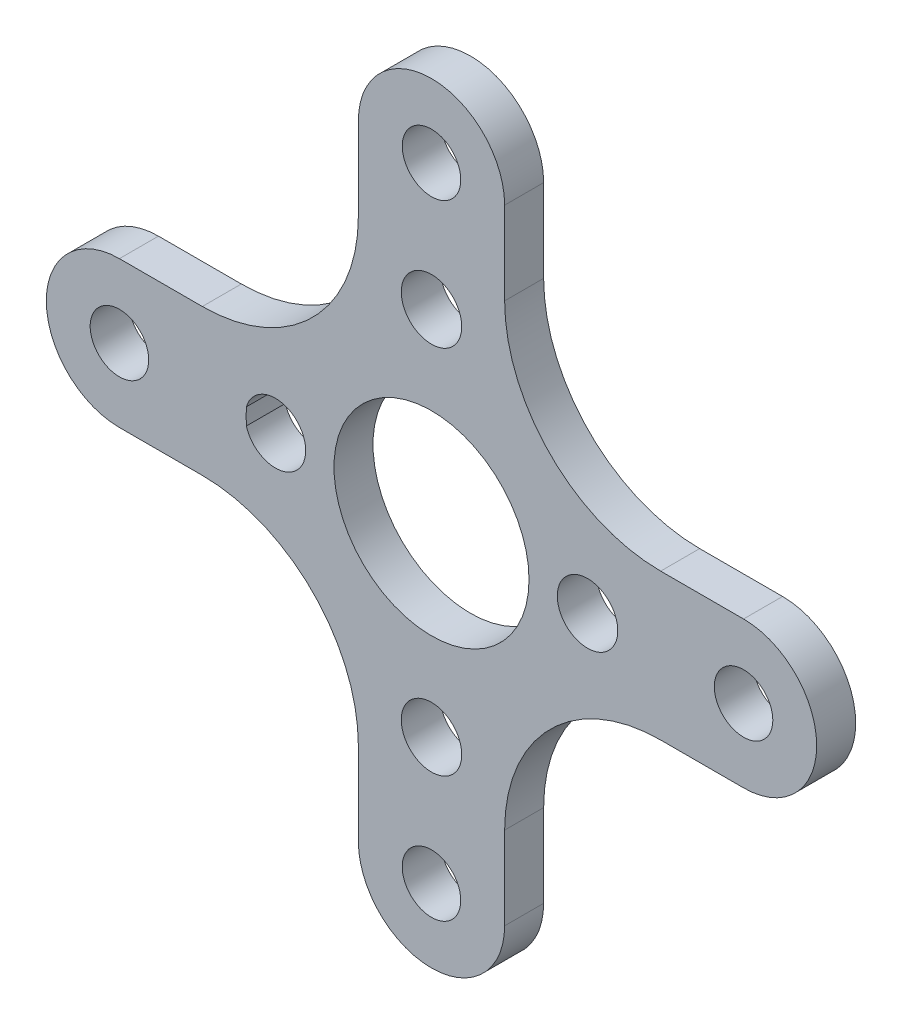
ISO-10303-21;
HEADER;
FILE_DESCRIPTION(('STEP AP214'),'2;1');
FILE_NAME('part.step','',(''),(''),'','','');
FILE_SCHEMA(('AUTOMOTIVE_DESIGN { 1 0 10303 214 1 1 1 1 }'));
ENDSEC;
DATA;
#1=APPLICATION_CONTEXT('core data for automotive mechanical design processes');
#2=APPLICATION_PROTOCOL_DEFINITION('international standard','automotive_design',2000,#1);
#3=PRODUCT_CONTEXT('',#1,'mechanical');
#4=PRODUCT('Part','Part','',(#3));
#5=PRODUCT_RELATED_PRODUCT_CATEGORY('part','',(#4));
#6=PRODUCT_DEFINITION_FORMATION('','',#4);
#7=PRODUCT_DEFINITION_CONTEXT('part definition',#1,'design');
#8=PRODUCT_DEFINITION('design','',#6,#7);
#9=PRODUCT_DEFINITION_SHAPE('','',#8);
#10=(LENGTH_UNIT() NAMED_UNIT(*) SI_UNIT(.MILLI.,.METRE.));
#11=(NAMED_UNIT(*) PLANE_ANGLE_UNIT() SI_UNIT($,.RADIAN.));
#12=(NAMED_UNIT(*) SI_UNIT($,.STERADIAN.) SOLID_ANGLE_UNIT());
#13=UNCERTAINTY_MEASURE_WITH_UNIT(LENGTH_MEASURE(1.E-05),#10,'distance_accuracy_value','');
#14=(GEOMETRIC_REPRESENTATION_CONTEXT(3) GLOBAL_UNCERTAINTY_ASSIGNED_CONTEXT((#13)) GLOBAL_UNIT_ASSIGNED_CONTEXT((#10,
#11,#12)) REPRESENTATION_CONTEXT('',''));
#15=CARTESIAN_POINT('',(0.,0.,0.));
#16=DIRECTION('',(0.,0.,1.));
#17=DIRECTION('',(1.,0.,0.));
#18=AXIS2_PLACEMENT_3D('',#15,#16,#17);
#19=CARTESIAN_POINT('',(-11.7499999999999,11.7499999999999,2.));
#20=DIRECTION('',(0.,0.,-1.));
#21=DIRECTION('',(-1.,0.,0.));
#22=AXIS2_PLACEMENT_3D('',#19,#20,#21);
#23=PLANE('',#22);
#24=CARTESIAN_POINT('',(8.,0.,2.));
#25=DIRECTION('',(0.,0.,-1.));
#26=DIRECTION('',(-1.,0.,0.));
#27=AXIS2_PLACEMENT_3D('',#24,#25,#26);
#28=CIRCLE('',#27,1.55);
#29=CARTESIAN_POINT('',(6.45,0.,2.));
#30=VERTEX_POINT('',#29);
#31=EDGE_CURVE('E187',#30,#30,#28,.T.);
#32=ORIENTED_EDGE('',*,*,#31,.T.);
#33=EDGE_LOOP('',(#32));
#34=FACE_BOUND('',#33,.T.);
#35=CARTESIAN_POINT('',(0.,-9.5,2.));
#36=DIRECTION('',(0.,0.,-1.));
#37=DIRECTION('',(-1.,0.,0.));
#38=AXIS2_PLACEMENT_3D('',#35,#36,#37);
#39=CIRCLE('',#38,1.55);
#40=CARTESIAN_POINT('',(-1.55,-9.5,2.));
#41=VERTEX_POINT('',#40);
#42=EDGE_CURVE('E184',#41,#41,#39,.T.);
#43=ORIENTED_EDGE('',*,*,#42,.T.);
#44=EDGE_LOOP('',(#43));
#45=FACE_BOUND('',#44,.T.);
#46=CARTESIAN_POINT('',(-8.,0.,2.));
#47=DIRECTION('',(0.,0.,-1.));
#48=DIRECTION('',(-1.,0.,0.));
#49=AXIS2_PLACEMENT_3D('',#46,#47,#48);
#50=CIRCLE('',#49,1.55);
#51=CARTESIAN_POINT('',(-9.49046875,0.425444362136153,2.));
#52=VERTEX_POINT('',#51);
#53=CARTESIAN_POINT('',(-9.49046875,-0.425444362136152,2.));
#54=VERTEX_POINT('',#53);
#55=EDGE_CURVE('E181',#52,#54,#50,.T.);
#56=ORIENTED_EDGE('',*,*,#55,.T.);
#57=CARTESIAN_POINT('',(0.,0.,2.));
#58=DIRECTION('',(0.,0.,-1.));
#59=DIRECTION('',(-1.,0.,0.));
#60=AXIS2_PLACEMENT_3D('',#57,#58,#59);
#61=CIRCLE('',#60,9.5);
#62=EDGE_CURVE('E158',#54,#52,#61,.T.);
#63=ORIENTED_EDGE('',*,*,#62,.T.);
#64=EDGE_LOOP('',(#56,#63));
#65=FACE_BOUND('',#64,.T.);
#66=CARTESIAN_POINT('',(0.,9.5,2.));
#67=DIRECTION('',(0.,0.,-1.));
#68=DIRECTION('',(-1.,0.,0.));
#69=AXIS2_PLACEMENT_3D('',#66,#67,#68);
#70=CIRCLE('',#69,1.55);
#71=CARTESIAN_POINT('',(-1.55,9.5,2.));
#72=VERTEX_POINT('',#71);
#73=EDGE_CURVE('E178',#72,#72,#70,.T.);
#74=ORIENTED_EDGE('',*,*,#73,.T.);
#75=EDGE_LOOP('',(#74));
#76=FACE_BOUND('',#75,.T.);
#77=CARTESIAN_POINT('',(-11.7499999999999,11.7499999999999,2.));
#78=DIRECTION('',(0.,0.,-1.));
#79=DIRECTION('',(-1.,0.,0.));
#80=AXIS2_PLACEMENT_3D('',#77,#78,#79);
#81=CIRCLE('',#80,8.);
#82=CARTESIAN_POINT('',(-3.74999999999994,11.7499999999999,2.));
#83=VERTEX_POINT('',#82);
#84=CARTESIAN_POINT('',(-11.7499999999999,3.74999999999995,2.));
#85=VERTEX_POINT('',#84);
#86=EDGE_CURVE('E221',#83,#85,#81,.T.);
#87=ORIENTED_EDGE('',*,*,#86,.T.);
#88=DIRECTION('',(-1.,0.,0.));
#89=VECTOR('',#88,1.);
#90=CARTESIAN_POINT('',(-16.0000000000001,3.74999999999994,2.));
#91=LINE('',#90,#89);
#92=CARTESIAN_POINT('',(-16.0000000000001,3.75,2.));
#93=VERTEX_POINT('',#92);
#94=EDGE_CURVE('E224',#85,#93,#91,.T.);
#95=ORIENTED_EDGE('',*,*,#94,.T.);
#96=CARTESIAN_POINT('',(-16.0000000000001,0.,2.));
#97=DIRECTION('',(0.,0.,1.));
#98=DIRECTION('',(1.,0.,0.));
#99=AXIS2_PLACEMENT_3D('',#96,#97,#98);
#100=CIRCLE('',#99,3.74999999999994);
#101=CARTESIAN_POINT('',(-16.0000000000001,-3.74999999999995,2.));
#102=VERTEX_POINT('',#101);
#103=EDGE_CURVE('E227',#93,#102,#100,.T.);
#104=ORIENTED_EDGE('',*,*,#103,.T.);
#105=DIRECTION('',(1.,0.,0.));
#106=VECTOR('',#105,1.);
#107=CARTESIAN_POINT('',(-16.0000000000001,-3.74999999999995,2.));
#108=LINE('',#107,#106);
#109=CARTESIAN_POINT('',(-11.75,-3.74999999999994,2.));
#110=VERTEX_POINT('',#109);
#111=EDGE_CURVE('E229',#102,#110,#108,.T.);
#112=ORIENTED_EDGE('',*,*,#111,.T.);
#113=CARTESIAN_POINT('',(-11.75,-11.7499999999999,2.));
#114=DIRECTION('',(0.,0.,-1.));
#115=DIRECTION('',(1.,0.,0.));
#116=AXIS2_PLACEMENT_3D('',#113,#114,#115);
#117=CIRCLE('',#116,8.);
#118=CARTESIAN_POINT('',(-3.75,-11.7499999999999,2.));
#119=VERTEX_POINT('',#118);
#120=EDGE_CURVE('E231',#110,#119,#117,.T.);
#121=ORIENTED_EDGE('',*,*,#120,.T.);
#122=DIRECTION('',(0.,-1.,0.));
#123=VECTOR('',#122,1.);
#124=CARTESIAN_POINT('',(-3.75,-16.0000000000001,2.));
#125=LINE('',#124,#123);
#126=CARTESIAN_POINT('',(-3.75000000000005,-16.0000000000001,2.));
#127=VERTEX_POINT('',#126);
#128=EDGE_CURVE('E233',#119,#127,#125,.T.);
#129=ORIENTED_EDGE('',*,*,#128,.T.);
#130=CARTESIAN_POINT('',(-1.08040746488181E-13,-16.0000000000001,2.));
#131=DIRECTION('',(0.,0.,1.));
#132=DIRECTION('',(1.,0.,0.));
#133=AXIS2_PLACEMENT_3D('',#130,#131,#132);
#134=CIRCLE('',#133,3.74999999999994);
#135=CARTESIAN_POINT('',(3.74999999999989,-16.0000000000001,2.));
#136=VERTEX_POINT('',#135);
#137=EDGE_CURVE('E235',#127,#136,#134,.T.);
#138=ORIENTED_EDGE('',*,*,#137,.T.);
#139=DIRECTION('',(0.,1.,0.));
#140=VECTOR('',#139,1.);
#141=CARTESIAN_POINT('',(3.74999999999989,-16.0000000000001,2.));
#142=LINE('',#141,#140);
#143=CARTESIAN_POINT('',(3.74999999999989,-11.75,2.));
#144=VERTEX_POINT('',#143);
#145=EDGE_CURVE('E237',#136,#144,#142,.T.);
#146=ORIENTED_EDGE('',*,*,#145,.T.);
#147=CARTESIAN_POINT('',(11.7499999999999,-11.75,2.));
#148=DIRECTION('',(0.,0.,-1.));
#149=DIRECTION('',(1.,0.,0.));
#150=AXIS2_PLACEMENT_3D('',#147,#148,#149);
#151=CIRCLE('',#150,8.);
#152=CARTESIAN_POINT('',(11.7499999999999,-3.75,2.));
#153=VERTEX_POINT('',#152);
#154=EDGE_CURVE('E239',#144,#153,#151,.T.);
#155=ORIENTED_EDGE('',*,*,#154,.T.);
#156=DIRECTION('',(1.,0.,0.));
#157=VECTOR('',#156,1.);
#158=CARTESIAN_POINT('',(16.,-3.75,2.));
#159=LINE('',#158,#157);
#160=CARTESIAN_POINT('',(16.,-3.75000000000006,2.));
#161=VERTEX_POINT('',#160);
#162=EDGE_CURVE('E241',#153,#161,#159,.T.);
#163=ORIENTED_EDGE('',*,*,#162,.T.);
#164=CARTESIAN_POINT('',(16.,-1.11727033874631E-13,2.));
#165=DIRECTION('',(0.,0.,1.));
#166=DIRECTION('',(1.,0.,0.));
#167=AXIS2_PLACEMENT_3D('',#164,#165,#166);
#168=CIRCLE('',#167,3.74999999999994);
#169=CARTESIAN_POINT('',(16.,3.74999999999989,2.));
#170=VERTEX_POINT('',#169);
#171=EDGE_CURVE('E243',#161,#170,#168,.T.);
#172=ORIENTED_EDGE('',*,*,#171,.T.);
#173=DIRECTION('',(-1.,0.,0.));
#174=VECTOR('',#173,1.);
#175=CARTESIAN_POINT('',(16.,3.74999999999989,2.));
#176=LINE('',#175,#174);
#177=CARTESIAN_POINT('',(11.7499999999999,3.74999999999989,2.));
#178=VERTEX_POINT('',#177);
#179=EDGE_CURVE('E245',#170,#178,#176,.T.);
#180=ORIENTED_EDGE('',*,*,#179,.T.);
#181=CARTESIAN_POINT('',(11.7499999999999,11.7499999999999,2.));
#182=DIRECTION('',(0.,0.,-1.));
#183=DIRECTION('',(1.,0.,0.));
#184=AXIS2_PLACEMENT_3D('',#181,#182,#183);
#185=CIRCLE('',#184,8.);
#186=CARTESIAN_POINT('',(3.74999999999994,11.7499999999999,2.));
#187=VERTEX_POINT('',#186);
#188=EDGE_CURVE('E247',#178,#187,#185,.T.);
#189=ORIENTED_EDGE('',*,*,#188,.T.);
#190=DIRECTION('',(0.,1.,0.));
#191=VECTOR('',#190,1.);
#192=CARTESIAN_POINT('',(3.74999999999994,16.,2.));
#193=LINE('',#192,#191);
#194=CARTESIAN_POINT('',(3.75,16.,2.));
#195=VERTEX_POINT('',#194);
#196=EDGE_CURVE('E249',#187,#195,#193,.T.);
#197=ORIENTED_EDGE('',*,*,#196,.T.);
#198=CARTESIAN_POINT('',(0.,16.,2.));
#199=DIRECTION('',(0.,0.,1.));
#200=DIRECTION('',(1.,0.,0.));
#201=AXIS2_PLACEMENT_3D('',#198,#199,#200);
#202=CIRCLE('',#201,3.74999999999994);
#203=CARTESIAN_POINT('',(-3.74999999999994,16.,2.));
#204=VERTEX_POINT('',#203);
#205=EDGE_CURVE('E251',#195,#204,#202,.T.);
#206=ORIENTED_EDGE('',*,*,#205,.T.);
#207=DIRECTION('',(0.,-1.,0.));
#208=VECTOR('',#207,1.);
#209=CARTESIAN_POINT('',(-3.74999999999994,16.,2.));
#210=LINE('',#209,#208);
#211=EDGE_CURVE('E253',#204,#83,#210,.T.);
#212=ORIENTED_EDGE('',*,*,#211,.T.);
#213=EDGE_LOOP('',(#87,#95,#104,#112,#121,#129,#138,#146,#155,#163,#172,#180,#189,#197,#206,#212));
#214=FACE_BOUND('',#213,.T.);
#215=CARTESIAN_POINT('',(0.,0.,2.));
#216=DIRECTION('',(0.,0.,1.));
#217=DIRECTION('',(1.,0.,0.));
#218=AXIS2_PLACEMENT_3D('',#215,#216,#217);
#219=CIRCLE('',#218,5.);
#220=CARTESIAN_POINT('',(5.,0.,2.));
#221=VERTEX_POINT('',#220);
#222=EDGE_CURVE('E215',#221,#221,#219,.T.);
#223=ORIENTED_EDGE('',*,*,#222,.F.);
#224=EDGE_LOOP('',(#223));
#225=FACE_BOUND('',#224,.T.);
#226=CARTESIAN_POINT('',(-16.,0.,2.));
#227=DIRECTION('',(0.,0.,1.));
#228=DIRECTION('',(1.,0.,0.));
#229=AXIS2_PLACEMENT_3D('',#226,#227,#228);
#230=CIRCLE('',#229,1.5);
#231=CARTESIAN_POINT('',(-14.5,0.,2.));
#232=VERTEX_POINT('',#231);
#233=EDGE_CURVE('E209',#232,#232,#230,.T.);
#234=ORIENTED_EDGE('',*,*,#233,.F.);
#235=EDGE_LOOP('',(#234));
#236=FACE_BOUND('',#235,.T.);
#237=CARTESIAN_POINT('',(0.,16.,2.));
#238=DIRECTION('',(0.,0.,1.));
#239=DIRECTION('',(1.,0.,0.));
#240=AXIS2_PLACEMENT_3D('',#237,#238,#239);
#241=CIRCLE('',#240,1.5);
#242=CARTESIAN_POINT('',(1.50000000000006,16.,2.));
#243=VERTEX_POINT('',#242);
#244=EDGE_CURVE('E203',#243,#243,#241,.T.);
#245=ORIENTED_EDGE('',*,*,#244,.F.);
#246=EDGE_LOOP('',(#245));
#247=FACE_BOUND('',#246,.T.);
#248=CARTESIAN_POINT('',(16.,-1.11727033874631E-13,2.));
#249=DIRECTION('',(0.,0.,1.));
#250=DIRECTION('',(1.,0.,0.));
#251=AXIS2_PLACEMENT_3D('',#248,#249,#250);
#252=CIRCLE('',#251,1.5);
#253=CARTESIAN_POINT('',(17.5,-1.11727033874631E-13,2.));
#254=VERTEX_POINT('',#253);
#255=EDGE_CURVE('E197',#254,#254,#252,.T.);
#256=ORIENTED_EDGE('',*,*,#255,.F.);
#257=EDGE_LOOP('',(#256));
#258=FACE_BOUND('',#257,.T.);
#259=CARTESIAN_POINT('',(-1.6759110426447E-13,-16.,2.));
#260=DIRECTION('',(0.,0.,1.));
#261=DIRECTION('',(1.,0.,0.));
#262=AXIS2_PLACEMENT_3D('',#259,#260,#261);
#263=CIRCLE('',#262,1.5);
#264=CARTESIAN_POINT('',(1.49999999999984,-16.,2.));
#265=VERTEX_POINT('',#264);
#266=EDGE_CURVE('E191',#265,#265,#263,.T.);
#267=ORIENTED_EDGE('',*,*,#266,.F.);
#268=EDGE_LOOP('',(#267));
#269=FACE_BOUND('',#268,.T.);
#270=ADVANCED_FACE('F33',(#34,#45,#65,#76,#214,#225,#236,#247,#258,#269),#23,.F.);
#271=CARTESIAN_POINT('',(-11.7499999999999,11.7499999999999,0.));
#272=DIRECTION('',(0.,0.,-1.));
#273=DIRECTION('',(-1.,0.,0.));
#274=AXIS2_PLACEMENT_3D('',#271,#272,#273);
#275=PLANE('',#274);
#276=CARTESIAN_POINT('',(8.,0.,0.));
#277=DIRECTION('',(0.,0.,-1.));
#278=DIRECTION('',(-1.,0.,0.));
#279=AXIS2_PLACEMENT_3D('',#276,#277,#278);
#280=CIRCLE('',#279,1.55);
#281=CARTESIAN_POINT('',(6.45,0.,0.));
#282=VERTEX_POINT('',#281);
#283=EDGE_CURVE('E173',#282,#282,#280,.T.);
#284=ORIENTED_EDGE('',*,*,#283,.F.);
#285=EDGE_LOOP('',(#284));
#286=FACE_BOUND('',#285,.T.);
#287=CARTESIAN_POINT('',(0.,-9.5,0.));
#288=DIRECTION('',(0.,0.,-1.));
#289=DIRECTION('',(-1.,0.,0.));
#290=AXIS2_PLACEMENT_3D('',#287,#288,#289);
#291=CIRCLE('',#290,1.55);
#292=CARTESIAN_POINT('',(-1.55,-9.5,0.));
#293=VERTEX_POINT('',#292);
#294=EDGE_CURVE('E170',#293,#293,#291,.T.);
#295=ORIENTED_EDGE('',*,*,#294,.F.);
#296=EDGE_LOOP('',(#295));
#297=FACE_BOUND('',#296,.T.);
#298=CARTESIAN_POINT('',(0.,0.,0.));
#299=DIRECTION('',(0.,0.,-1.));
#300=DIRECTION('',(-1.,0.,0.));
#301=AXIS2_PLACEMENT_3D('',#298,#299,#300);
#302=CIRCLE('',#301,9.5);
#303=CARTESIAN_POINT('',(-9.49046875,-0.425444362136153,0.));
#304=VERTEX_POINT('',#303);
#305=CARTESIAN_POINT('',(-9.49046875,0.425444362136152,0.));
#306=VERTEX_POINT('',#305);
#307=EDGE_CURVE('E55',#304,#306,#302,.T.);
#308=ORIENTED_EDGE('',*,*,#307,.F.);
#309=CARTESIAN_POINT('',(-8.,0.,0.));
#310=DIRECTION('',(0.,0.,-1.));
#311=DIRECTION('',(-1.,0.,0.));
#312=AXIS2_PLACEMENT_3D('',#309,#310,#311);
#313=CIRCLE('',#312,1.55);
#314=EDGE_CURVE('E164',#306,#304,#313,.T.);
#315=ORIENTED_EDGE('',*,*,#314,.F.);
#316=EDGE_LOOP('',(#308,#315));
#317=FACE_BOUND('',#316,.T.);
#318=CARTESIAN_POINT('',(0.,9.5,0.));
#319=DIRECTION('',(0.,0.,-1.));
#320=DIRECTION('',(-1.,0.,0.));
#321=AXIS2_PLACEMENT_3D('',#318,#319,#320);
#322=CIRCLE('',#321,1.55);
#323=CARTESIAN_POINT('',(-1.55,9.5,0.));
#324=VERTEX_POINT('',#323);
#325=EDGE_CURVE('E161',#324,#324,#322,.T.);
#326=ORIENTED_EDGE('',*,*,#325,.F.);
#327=EDGE_LOOP('',(#326));
#328=FACE_BOUND('',#327,.T.);
#329=CARTESIAN_POINT('',(16.,-1.11727033874631E-13,0.));
#330=DIRECTION('',(0.,0.,1.));
#331=DIRECTION('',(1.,0.,0.));
#332=AXIS2_PLACEMENT_3D('',#329,#330,#331);
#333=CIRCLE('',#332,1.5);
#334=CARTESIAN_POINT('',(17.5,-1.11727033874631E-13,0.));
#335=VERTEX_POINT('',#334);
#336=EDGE_CURVE('E194',#335,#335,#333,.T.);
#337=ORIENTED_EDGE('',*,*,#336,.T.);
#338=EDGE_LOOP('',(#337));
#339=FACE_BOUND('',#338,.T.);
#340=CARTESIAN_POINT('',(-16.,0.,0.));
#341=DIRECTION('',(0.,0.,1.));
#342=DIRECTION('',(1.,0.,0.));
#343=AXIS2_PLACEMENT_3D('',#340,#341,#342);
#344=CIRCLE('',#343,1.5);
#345=CARTESIAN_POINT('',(-14.5,0.,0.));
#346=VERTEX_POINT('',#345);
#347=EDGE_CURVE('E206',#346,#346,#344,.T.);
#348=ORIENTED_EDGE('',*,*,#347,.T.);
#349=EDGE_LOOP('',(#348));
#350=FACE_BOUND('',#349,.T.);
#351=CARTESIAN_POINT('',(-11.7499999999999,11.7499999999999,0.));
#352=DIRECTION('',(0.,0.,-1.));
#353=DIRECTION('',(-1.,0.,0.));
#354=AXIS2_PLACEMENT_3D('',#351,#352,#353);
#355=CIRCLE('',#354,8.);
#356=CARTESIAN_POINT('',(-3.74999999999994,11.7499999999999,0.));
#357=VERTEX_POINT('',#356);
#358=CARTESIAN_POINT('',(-11.7499999999999,3.74999999999995,0.));
#359=VERTEX_POINT('',#358);
#360=EDGE_CURVE('E218',#357,#359,#355,.T.);
#361=ORIENTED_EDGE('',*,*,#360,.F.);
#362=DIRECTION('',(0.,-1.,0.));
#363=VECTOR('',#362,1.);
#364=CARTESIAN_POINT('',(-3.74999999999994,16.,0.));
#365=LINE('',#364,#363);
#366=CARTESIAN_POINT('',(-3.74999999999994,16.,0.));
#367=VERTEX_POINT('',#366);
#368=EDGE_CURVE('E225',#367,#357,#365,.T.);
#369=ORIENTED_EDGE('',*,*,#368,.F.);
#370=CARTESIAN_POINT('',(0.,16.,0.));
#371=DIRECTION('',(0.,0.,1.));
#372=DIRECTION('',(1.,0.,0.));
#373=AXIS2_PLACEMENT_3D('',#370,#371,#372);
#374=CIRCLE('',#373,3.74999999999994);
#375=CARTESIAN_POINT('',(3.75,16.,0.));
#376=VERTEX_POINT('',#375);
#377=EDGE_CURVE('E284',#376,#367,#374,.T.);
#378=ORIENTED_EDGE('',*,*,#377,.F.);
#379=DIRECTION('',(0.,1.,0.));
#380=VECTOR('',#379,1.);
#381=CARTESIAN_POINT('',(3.74999999999994,16.,0.));
#382=LINE('',#381,#380);
#383=CARTESIAN_POINT('',(3.74999999999994,11.7499999999999,0.));
#384=VERTEX_POINT('',#383);
#385=EDGE_CURVE('E282',#384,#376,#382,.T.);
#386=ORIENTED_EDGE('',*,*,#385,.F.);
#387=CARTESIAN_POINT('',(11.7499999999999,11.7499999999999,0.));
#388=DIRECTION('',(0.,0.,-1.));
#389=DIRECTION('',(1.,0.,0.));
#390=AXIS2_PLACEMENT_3D('',#387,#388,#389);
#391=CIRCLE('',#390,8.);
#392=CARTESIAN_POINT('',(11.7499999999999,3.74999999999989,0.));
#393=VERTEX_POINT('',#392);
#394=EDGE_CURVE('E280',#393,#384,#391,.T.);
#395=ORIENTED_EDGE('',*,*,#394,.F.);
#396=DIRECTION('',(-1.,0.,0.));
#397=VECTOR('',#396,1.);
#398=CARTESIAN_POINT('',(16.,3.74999999999989,0.));
#399=LINE('',#398,#397);
#400=CARTESIAN_POINT('',(16.,3.74999999999989,0.));
#401=VERTEX_POINT('',#400);
#402=EDGE_CURVE('E278',#401,#393,#399,.T.);
#403=ORIENTED_EDGE('',*,*,#402,.F.);
#404=CARTESIAN_POINT('',(16.,-1.11727033874631E-13,0.));
#405=DIRECTION('',(0.,0.,1.));
#406=DIRECTION('',(1.,0.,0.));
#407=AXIS2_PLACEMENT_3D('',#404,#405,#406);
#408=CIRCLE('',#407,3.74999999999994);
#409=CARTESIAN_POINT('',(16.,-3.75000000000006,0.));
#410=VERTEX_POINT('',#409);
#411=EDGE_CURVE('E276',#410,#401,#408,.T.);
#412=ORIENTED_EDGE('',*,*,#411,.F.);
#413=DIRECTION('',(1.,0.,0.));
#414=VECTOR('',#413,1.);
#415=CARTESIAN_POINT('',(16.,-3.75,0.));
#416=LINE('',#415,#414);
#417=CARTESIAN_POINT('',(11.7499999999999,-3.75,0.));
#418=VERTEX_POINT('',#417);
#419=EDGE_CURVE('E274',#418,#410,#416,.T.);
#420=ORIENTED_EDGE('',*,*,#419,.F.);
#421=CARTESIAN_POINT('',(11.7499999999999,-11.75,0.));
#422=DIRECTION('',(0.,0.,-1.));
#423=DIRECTION('',(1.,0.,0.));
#424=AXIS2_PLACEMENT_3D('',#421,#422,#423);
#425=CIRCLE('',#424,8.);
#426=CARTESIAN_POINT('',(3.74999999999989,-11.75,0.));
#427=VERTEX_POINT('',#426);
#428=EDGE_CURVE('E272',#427,#418,#425,.T.);
#429=ORIENTED_EDGE('',*,*,#428,.F.);
#430=DIRECTION('',(0.,1.,0.));
#431=VECTOR('',#430,1.);
#432=CARTESIAN_POINT('',(3.74999999999989,-16.0000000000001,0.));
#433=LINE('',#432,#431);
#434=CARTESIAN_POINT('',(3.74999999999989,-16.0000000000001,0.));
#435=VERTEX_POINT('',#434);
#436=EDGE_CURVE('E270',#435,#427,#433,.T.);
#437=ORIENTED_EDGE('',*,*,#436,.F.);
#438=CARTESIAN_POINT('',(-1.08040746488181E-13,-16.0000000000001,0.));
#439=DIRECTION('',(0.,0.,1.));
#440=DIRECTION('',(1.,0.,0.));
#441=AXIS2_PLACEMENT_3D('',#438,#439,#440);
#442=CIRCLE('',#441,3.74999999999994);
#443=CARTESIAN_POINT('',(-3.75000000000005,-16.0000000000001,0.));
#444=VERTEX_POINT('',#443);
#445=EDGE_CURVE('E268',#444,#435,#442,.T.);
#446=ORIENTED_EDGE('',*,*,#445,.F.);
#447=DIRECTION('',(0.,-1.,0.));
#448=VECTOR('',#447,1.);
#449=CARTESIAN_POINT('',(-3.75,-16.0000000000001,0.));
#450=LINE('',#449,#448);
#451=CARTESIAN_POINT('',(-3.75,-11.7499999999999,0.));
#452=VERTEX_POINT('',#451);
#453=EDGE_CURVE('E266',#452,#444,#450,.T.);
#454=ORIENTED_EDGE('',*,*,#453,.F.);
#455=CARTESIAN_POINT('',(-11.75,-11.7499999999999,0.));
#456=DIRECTION('',(0.,0.,-1.));
#457=DIRECTION('',(1.,0.,0.));
#458=AXIS2_PLACEMENT_3D('',#455,#456,#457);
#459=CIRCLE('',#458,8.);
#460=CARTESIAN_POINT('',(-11.75,-3.74999999999994,0.));
#461=VERTEX_POINT('',#460);
#462=EDGE_CURVE('E264',#461,#452,#459,.T.);
#463=ORIENTED_EDGE('',*,*,#462,.F.);
#464=DIRECTION('',(1.,0.,0.));
#465=VECTOR('',#464,1.);
#466=CARTESIAN_POINT('',(-16.0000000000001,-3.74999999999995,0.));
#467=LINE('',#466,#465);
#468=CARTESIAN_POINT('',(-16.0000000000001,-3.74999999999995,0.));
#469=VERTEX_POINT('',#468);
#470=EDGE_CURVE('E262',#469,#461,#467,.T.);
#471=ORIENTED_EDGE('',*,*,#470,.F.);
#472=CARTESIAN_POINT('',(-16.0000000000001,0.,0.));
#473=DIRECTION('',(0.,0.,1.));
#474=DIRECTION('',(1.,0.,0.));
#475=AXIS2_PLACEMENT_3D('',#472,#473,#474);
#476=CIRCLE('',#475,3.74999999999994);
#477=CARTESIAN_POINT('',(-16.0000000000001,3.75,0.));
#478=VERTEX_POINT('',#477);
#479=EDGE_CURVE('E260',#478,#469,#476,.T.);
#480=ORIENTED_EDGE('',*,*,#479,.F.);
#481=DIRECTION('',(-1.,0.,0.));
#482=VECTOR('',#481,1.);
#483=CARTESIAN_POINT('',(-16.0000000000001,3.74999999999994,0.));
#484=LINE('',#483,#482);
#485=EDGE_CURVE('E258',#359,#478,#484,.T.);
#486=ORIENTED_EDGE('',*,*,#485,.F.);
#487=EDGE_LOOP('',(#361,#369,#378,#386,#395,#403,#412,#420,#429,#437,#446,#454,#463,#471,#480,#486));
#488=FACE_BOUND('',#487,.T.);
#489=CARTESIAN_POINT('',(0.,0.,0.));
#490=DIRECTION('',(0.,0.,1.));
#491=DIRECTION('',(1.,0.,0.));
#492=AXIS2_PLACEMENT_3D('',#489,#490,#491);
#493=CIRCLE('',#492,5.);
#494=CARTESIAN_POINT('',(5.,0.,0.));
#495=VERTEX_POINT('',#494);
#496=EDGE_CURVE('E212',#495,#495,#493,.T.);
#497=ORIENTED_EDGE('',*,*,#496,.T.);
#498=EDGE_LOOP('',(#497));
#499=FACE_BOUND('',#498,.T.);
#500=CARTESIAN_POINT('',(0.,16.,0.));
#501=DIRECTION('',(0.,0.,1.));
#502=DIRECTION('',(1.,0.,0.));
#503=AXIS2_PLACEMENT_3D('',#500,#501,#502);
#504=CIRCLE('',#503,1.5);
#505=CARTESIAN_POINT('',(1.50000000000006,16.,0.));
#506=VERTEX_POINT('',#505);
#507=EDGE_CURVE('E200',#506,#506,#504,.T.);
#508=ORIENTED_EDGE('',*,*,#507,.T.);
#509=EDGE_LOOP('',(#508));
#510=FACE_BOUND('',#509,.T.);
#511=CARTESIAN_POINT('',(-1.6759110426447E-13,-16.,0.));
#512=DIRECTION('',(0.,0.,1.));
#513=DIRECTION('',(1.,0.,0.));
#514=AXIS2_PLACEMENT_3D('',#511,#512,#513);
#515=CIRCLE('',#514,1.5);
#516=CARTESIAN_POINT('',(1.49999999999984,-16.,0.));
#517=VERTEX_POINT('',#516);
#518=EDGE_CURVE('E190',#517,#517,#515,.T.);
#519=ORIENTED_EDGE('',*,*,#518,.T.);
#520=EDGE_LOOP('',(#519));
#521=FACE_BOUND('',#520,.T.);
#522=ADVANCED_FACE('F168',(#286,#297,#317,#328,#339,#350,#488,#499,#510,#521),#275,.T.);
#523=CARTESIAN_POINT('',(-11.7499999999999,11.7499999999999,2.));
#524=DIRECTION('',(0.,0.,-1.));
#525=DIRECTION('',(-1.,0.,0.));
#526=AXIS2_PLACEMENT_3D('',#523,#524,#525);
#527=CYLINDRICAL_SURFACE('',#526,8.);
#528=ORIENTED_EDGE('',*,*,#360,.T.);
#529=DIRECTION('',(0.,0.,-1.));
#530=VECTOR('',#529,1.);
#531=CARTESIAN_POINT('',(-11.7499999999999,3.74999999999995,2.));
#532=LINE('',#531,#530);
#533=EDGE_CURVE('E11',#85,#359,#532,.T.);
#534=ORIENTED_EDGE('',*,*,#533,.F.);
#535=ORIENTED_EDGE('',*,*,#86,.F.);
#536=DIRECTION('',(0.,0.,-1.));
#537=VECTOR('',#536,1.);
#538=CARTESIAN_POINT('',(-3.74999999999994,11.7499999999999,2.));
#539=LINE('',#538,#537);
#540=EDGE_CURVE('E255',#83,#357,#539,.T.);
#541=ORIENTED_EDGE('',*,*,#540,.T.);
#542=EDGE_LOOP('',(#528,#534,#535,#541));
#543=FACE_BOUND('',#542,.T.);
#544=ADVANCED_FACE('F35',(#543),#527,.F.);
#545=CARTESIAN_POINT('',(-16.0000000000001,3.74999999999994,2.));
#546=DIRECTION('',(0.,-1.,0.));
#547=DIRECTION('',(1.,0.,0.));
#548=AXIS2_PLACEMENT_3D('',#545,#546,#547);
#549=PLANE('',#548);
#550=ORIENTED_EDGE('',*,*,#485,.T.);
#551=DIRECTION('',(0.,0.,-1.));
#552=VECTOR('',#551,1.);
#553=CARTESIAN_POINT('',(-16.0000000000001,3.75,2.));
#554=LINE('',#553,#552);
#555=EDGE_CURVE('E41',#93,#478,#554,.T.);
#556=ORIENTED_EDGE('',*,*,#555,.F.);
#557=ORIENTED_EDGE('',*,*,#94,.F.);
#558=ORIENTED_EDGE('',*,*,#533,.T.);
#559=EDGE_LOOP('',(#550,#556,#557,#558));
#560=FACE_BOUND('',#559,.T.);
#561=ADVANCED_FACE('F355',(#560),#549,.F.);
#562=CARTESIAN_POINT('',(-16.0000000000001,0.,2.));
#563=DIRECTION('',(0.,0.,-1.));
#564=DIRECTION('',(-1.,0.,0.));
#565=AXIS2_PLACEMENT_3D('',#562,#563,#564);
#566=CYLINDRICAL_SURFACE('',#565,3.74999999999994);
#567=ORIENTED_EDGE('',*,*,#479,.T.);
#568=DIRECTION('',(0.,0.,-1.));
#569=VECTOR('',#568,1.);
#570=CARTESIAN_POINT('',(-16.0000000000001,-3.74999999999995,2.));
#571=LINE('',#570,#569);
#572=EDGE_CURVE('E325',#102,#469,#571,.T.);
#573=ORIENTED_EDGE('',*,*,#572,.F.);
#574=ORIENTED_EDGE('',*,*,#103,.F.);
#575=ORIENTED_EDGE('',*,*,#555,.T.);
#576=EDGE_LOOP('',(#567,#573,#574,#575));
#577=FACE_BOUND('',#576,.T.);
#578=ADVANCED_FACE('F332',(#577),#566,.T.);
#579=CARTESIAN_POINT('',(-16.0000000000001,-3.74999999999995,2.));
#580=DIRECTION('',(0.,1.,0.));
#581=DIRECTION('',(-1.,0.,0.));
#582=AXIS2_PLACEMENT_3D('',#579,#580,#581);
#583=PLANE('',#582);
#584=ORIENTED_EDGE('',*,*,#470,.T.);
#585=DIRECTION('',(0.,0.,-1.));
#586=VECTOR('',#585,1.);
#587=CARTESIAN_POINT('',(-11.75,-3.74999999999994,2.));
#588=LINE('',#587,#586);
#589=EDGE_CURVE('E322',#110,#461,#588,.T.);
#590=ORIENTED_EDGE('',*,*,#589,.F.);
#591=ORIENTED_EDGE('',*,*,#111,.F.);
#592=ORIENTED_EDGE('',*,*,#572,.T.);
#593=EDGE_LOOP('',(#584,#590,#591,#592));
#594=FACE_BOUND('',#593,.T.);
#595=ADVANCED_FACE('F343',(#594),#583,.F.);
#596=CARTESIAN_POINT('',(-11.75,-11.7499999999999,2.));
#597=DIRECTION('',(0.,0.,-1.));
#598=DIRECTION('',(-1.,0.,0.));
#599=AXIS2_PLACEMENT_3D('',#596,#597,#598);
#600=CYLINDRICAL_SURFACE('',#599,8.);
#601=ORIENTED_EDGE('',*,*,#462,.T.);
#602=DIRECTION('',(0.,0.,-1.));
#603=VECTOR('',#602,1.);
#604=CARTESIAN_POINT('',(-3.75,-11.7499999999999,2.));
#605=LINE('',#604,#603);
#606=EDGE_CURVE('E319',#119,#452,#605,.T.);
#607=ORIENTED_EDGE('',*,*,#606,.F.);
#608=ORIENTED_EDGE('',*,*,#120,.F.);
#609=ORIENTED_EDGE('',*,*,#589,.T.);
#610=EDGE_LOOP('',(#601,#607,#608,#609));
#611=FACE_BOUND('',#610,.T.);
#612=ADVANCED_FACE('F347',(#611),#600,.F.);
#613=CARTESIAN_POINT('',(-3.75,-16.0000000000001,2.));
#614=DIRECTION('',(1.,0.,0.));
#615=DIRECTION('',(0.,1.,0.));
#616=AXIS2_PLACEMENT_3D('',#613,#614,#615);
#617=PLANE('',#616);
#618=ORIENTED_EDGE('',*,*,#453,.T.);
#619=DIRECTION('',(0.,0.,-1.));
#620=VECTOR('',#619,1.);
#621=CARTESIAN_POINT('',(-3.75000000000005,-16.0000000000001,2.));
#622=LINE('',#621,#620);
#623=EDGE_CURVE('E316',#127,#444,#622,.T.);
#624=ORIENTED_EDGE('',*,*,#623,.F.);
#625=ORIENTED_EDGE('',*,*,#128,.F.);
#626=ORIENTED_EDGE('',*,*,#606,.T.);
#627=EDGE_LOOP('',(#618,#624,#625,#626));
#628=FACE_BOUND('',#627,.T.);
#629=ADVANCED_FACE('F408',(#628),#617,.F.);
#630=CARTESIAN_POINT('',(-1.08040746488181E-13,-16.0000000000001,2.));
#631=DIRECTION('',(0.,0.,-1.));
#632=DIRECTION('',(-1.,0.,0.));
#633=AXIS2_PLACEMENT_3D('',#630,#631,#632);
#634=CYLINDRICAL_SURFACE('',#633,3.74999999999994);
#635=ORIENTED_EDGE('',*,*,#445,.T.);
#636=DIRECTION('',(0.,0.,-1.));
#637=VECTOR('',#636,1.);
#638=CARTESIAN_POINT('',(3.74999999999989,-16.0000000000001,2.));
#639=LINE('',#638,#637);
#640=EDGE_CURVE('E313',#136,#435,#639,.T.);
#641=ORIENTED_EDGE('',*,*,#640,.F.);
#642=ORIENTED_EDGE('',*,*,#137,.F.);
#643=ORIENTED_EDGE('',*,*,#623,.T.);
#644=EDGE_LOOP('',(#635,#641,#642,#643));
#645=FACE_BOUND('',#644,.T.);
#646=ADVANCED_FACE('F405',(#645),#634,.T.);
#647=CARTESIAN_POINT('',(3.74999999999989,-16.0000000000001,2.));
#648=DIRECTION('',(-1.,0.,0.));
#649=DIRECTION('',(0.,-1.,0.));
#650=AXIS2_PLACEMENT_3D('',#647,#648,#649);
#651=PLANE('',#650);
#652=ORIENTED_EDGE('',*,*,#436,.T.);
#653=DIRECTION('',(0.,0.,-1.));
#654=VECTOR('',#653,1.);
#655=CARTESIAN_POINT('',(3.74999999999989,-11.75,2.));
#656=LINE('',#655,#654);
#657=EDGE_CURVE('E310',#144,#427,#656,.T.);
#658=ORIENTED_EDGE('',*,*,#657,.F.);
#659=ORIENTED_EDGE('',*,*,#145,.F.);
#660=ORIENTED_EDGE('',*,*,#640,.T.);
#661=EDGE_LOOP('',(#652,#658,#659,#660));
#662=FACE_BOUND('',#661,.T.);
#663=ADVANCED_FACE('F401',(#662),#651,.F.);
#664=CARTESIAN_POINT('',(11.7499999999999,-11.75,2.));
#665=DIRECTION('',(0.,0.,-1.));
#666=DIRECTION('',(-1.,0.,0.));
#667=AXIS2_PLACEMENT_3D('',#664,#665,#666);
#668=CYLINDRICAL_SURFACE('',#667,8.);
#669=ORIENTED_EDGE('',*,*,#428,.T.);
#670=DIRECTION('',(0.,0.,-1.));
#671=VECTOR('',#670,1.);
#672=CARTESIAN_POINT('',(11.7499999999999,-3.75,2.));
#673=LINE('',#672,#671);
#674=EDGE_CURVE('E307',#153,#418,#673,.T.);
#675=ORIENTED_EDGE('',*,*,#674,.F.);
#676=ORIENTED_EDGE('',*,*,#154,.F.);
#677=ORIENTED_EDGE('',*,*,#657,.T.);
#678=EDGE_LOOP('',(#669,#675,#676,#677));
#679=FACE_BOUND('',#678,.T.);
#680=ADVANCED_FACE('F397',(#679),#668,.F.);
#681=CARTESIAN_POINT('',(16.,-3.75,2.));
#682=DIRECTION('',(0.,1.,0.));
#683=DIRECTION('',(-1.,0.,0.));
#684=AXIS2_PLACEMENT_3D('',#681,#682,#683);
#685=PLANE('',#684);
#686=ORIENTED_EDGE('',*,*,#419,.T.);
#687=DIRECTION('',(0.,0.,-1.));
#688=VECTOR('',#687,1.);
#689=CARTESIAN_POINT('',(16.,-3.75000000000006,2.));
#690=LINE('',#689,#688);
#691=EDGE_CURVE('E304',#161,#410,#690,.T.);
#692=ORIENTED_EDGE('',*,*,#691,.F.);
#693=ORIENTED_EDGE('',*,*,#162,.F.);
#694=ORIENTED_EDGE('',*,*,#674,.T.);
#695=EDGE_LOOP('',(#686,#692,#693,#694));
#696=FACE_BOUND('',#695,.T.);
#697=ADVANCED_FACE('F392',(#696),#685,.F.);
#698=CARTESIAN_POINT('',(16.,-1.11727033874631E-13,2.));
#699=DIRECTION('',(0.,0.,-1.));
#700=DIRECTION('',(-1.,0.,0.));
#701=AXIS2_PLACEMENT_3D('',#698,#699,#700);
#702=CYLINDRICAL_SURFACE('',#701,3.74999999999994);
#703=ORIENTED_EDGE('',*,*,#411,.T.);
#704=DIRECTION('',(0.,0.,-1.));
#705=VECTOR('',#704,1.);
#706=CARTESIAN_POINT('',(16.,3.74999999999989,2.));
#707=LINE('',#706,#705);
#708=EDGE_CURVE('E301',#170,#401,#707,.T.);
#709=ORIENTED_EDGE('',*,*,#708,.F.);
#710=ORIENTED_EDGE('',*,*,#171,.F.);
#711=ORIENTED_EDGE('',*,*,#691,.T.);
#712=EDGE_LOOP('',(#703,#709,#710,#711));
#713=FACE_BOUND('',#712,.T.);
#714=ADVANCED_FACE('F386',(#713),#702,.T.);
#715=CARTESIAN_POINT('',(16.,3.74999999999989,2.));
#716=DIRECTION('',(0.,-1.,0.));
#717=DIRECTION('',(1.,0.,0.));
#718=AXIS2_PLACEMENT_3D('',#715,#716,#717);
#719=PLANE('',#718);
#720=ORIENTED_EDGE('',*,*,#402,.T.);
#721=DIRECTION('',(0.,0.,-1.));
#722=VECTOR('',#721,1.);
#723=CARTESIAN_POINT('',(11.7499999999999,3.74999999999989,2.));
#724=LINE('',#723,#722);
#725=EDGE_CURVE('E298',#178,#393,#724,.T.);
#726=ORIENTED_EDGE('',*,*,#725,.F.);
#727=ORIENTED_EDGE('',*,*,#179,.F.);
#728=ORIENTED_EDGE('',*,*,#708,.T.);
#729=EDGE_LOOP('',(#720,#726,#727,#728));
#730=FACE_BOUND('',#729,.T.);
#731=ADVANCED_FACE('F382',(#730),#719,.F.);
#732=CARTESIAN_POINT('',(11.7499999999999,11.7499999999999,2.));
#733=DIRECTION('',(0.,0.,-1.));
#734=DIRECTION('',(-1.,0.,0.));
#735=AXIS2_PLACEMENT_3D('',#732,#733,#734);
#736=CYLINDRICAL_SURFACE('',#735,8.);
#737=ORIENTED_EDGE('',*,*,#394,.T.);
#738=DIRECTION('',(0.,0.,-1.));
#739=VECTOR('',#738,1.);
#740=CARTESIAN_POINT('',(3.74999999999994,11.7499999999999,2.));
#741=LINE('',#740,#739);
#742=EDGE_CURVE('E295',#187,#384,#741,.T.);
#743=ORIENTED_EDGE('',*,*,#742,.F.);
#744=ORIENTED_EDGE('',*,*,#188,.F.);
#745=ORIENTED_EDGE('',*,*,#725,.T.);
#746=EDGE_LOOP('',(#737,#743,#744,#745));
#747=FACE_BOUND('',#746,.T.);
#748=ADVANCED_FACE('F377',(#747),#736,.F.);
#749=CARTESIAN_POINT('',(3.74999999999994,16.,2.));
#750=DIRECTION('',(-1.,0.,0.));
#751=DIRECTION('',(0.,0.,1.));
#752=AXIS2_PLACEMENT_3D('',#749,#750,#751);
#753=PLANE('',#752);
#754=ORIENTED_EDGE('',*,*,#385,.T.);
#755=DIRECTION('',(0.,0.,-1.));
#756=VECTOR('',#755,1.);
#757=CARTESIAN_POINT('',(3.75,16.,2.));
#758=LINE('',#757,#756);
#759=EDGE_CURVE('E292',#195,#376,#758,.T.);
#760=ORIENTED_EDGE('',*,*,#759,.F.);
#761=ORIENTED_EDGE('',*,*,#196,.F.);
#762=ORIENTED_EDGE('',*,*,#742,.T.);
#763=EDGE_LOOP('',(#754,#760,#761,#762));
#764=FACE_BOUND('',#763,.T.);
#765=ADVANCED_FACE('F371',(#764),#753,.F.);
#766=CARTESIAN_POINT('',(0.,16.,2.));
#767=DIRECTION('',(0.,0.,-1.));
#768=DIRECTION('',(-1.,0.,0.));
#769=AXIS2_PLACEMENT_3D('',#766,#767,#768);
#770=CYLINDRICAL_SURFACE('',#769,3.74999999999994);
#771=ORIENTED_EDGE('',*,*,#377,.T.);
#772=DIRECTION('',(0.,0.,-1.));
#773=VECTOR('',#772,1.);
#774=CARTESIAN_POINT('',(-3.74999999999994,16.,2.));
#775=LINE('',#774,#773);
#776=EDGE_CURVE('E289',#204,#367,#775,.T.);
#777=ORIENTED_EDGE('',*,*,#776,.F.);
#778=ORIENTED_EDGE('',*,*,#205,.F.);
#779=ORIENTED_EDGE('',*,*,#759,.T.);
#780=EDGE_LOOP('',(#771,#777,#778,#779));
#781=FACE_BOUND('',#780,.T.);
#782=ADVANCED_FACE('F367',(#781),#770,.T.);
#783=CARTESIAN_POINT('',(-3.74999999999994,16.,2.));
#784=DIRECTION('',(1.,0.,0.));
#785=DIRECTION('',(0.,1.,0.));
#786=AXIS2_PLACEMENT_3D('',#783,#784,#785);
#787=PLANE('',#786);
#788=ORIENTED_EDGE('',*,*,#368,.T.);
#789=ORIENTED_EDGE('',*,*,#540,.F.);
#790=ORIENTED_EDGE('',*,*,#211,.F.);
#791=ORIENTED_EDGE('',*,*,#776,.T.);
#792=EDGE_LOOP('',(#788,#789,#790,#791));
#793=FACE_BOUND('',#792,.T.);
#794=ADVANCED_FACE('F362',(#793),#787,.F.);
#795=CARTESIAN_POINT('',(0.,0.,2.));
#796=DIRECTION('',(0.,0.,-1.));
#797=DIRECTION('',(-1.,0.,0.));
#798=AXIS2_PLACEMENT_3D('',#795,#796,#797);
#799=CYLINDRICAL_SURFACE('',#798,5.);
#800=ORIENTED_EDGE('',*,*,#222,.T.);
#801=EDGE_LOOP('',(#800));
#802=FACE_BOUND('',#801,.T.);
#803=ORIENTED_EDGE('',*,*,#496,.F.);
#804=EDGE_LOOP('',(#803));
#805=FACE_BOUND('',#804,.T.);
#806=ADVANCED_FACE('F428',(#802,#805),#799,.F.);
#807=CARTESIAN_POINT('',(-16.,0.,2.));
#808=DIRECTION('',(0.,0.,-1.));
#809=DIRECTION('',(-1.,0.,0.));
#810=AXIS2_PLACEMENT_3D('',#807,#808,#809);
#811=CYLINDRICAL_SURFACE('',#810,1.5);
#812=ORIENTED_EDGE('',*,*,#233,.T.);
#813=EDGE_LOOP('',(#812));
#814=FACE_BOUND('',#813,.T.);
#815=ORIENTED_EDGE('',*,*,#347,.F.);
#816=EDGE_LOOP('',(#815));
#817=FACE_BOUND('',#816,.T.);
#818=ADVANCED_FACE('F490',(#814,#817),#811,.F.);
#819=CARTESIAN_POINT('',(0.,16.,2.));
#820=DIRECTION('',(0.,0.,-1.));
#821=DIRECTION('',(-1.,0.,0.));
#822=AXIS2_PLACEMENT_3D('',#819,#820,#821);
#823=CYLINDRICAL_SURFACE('',#822,1.5);
#824=ORIENTED_EDGE('',*,*,#244,.T.);
#825=EDGE_LOOP('',(#824));
#826=FACE_BOUND('',#825,.T.);
#827=ORIENTED_EDGE('',*,*,#507,.F.);
#828=EDGE_LOOP('',(#827));
#829=FACE_BOUND('',#828,.T.);
#830=ADVANCED_FACE('F497',(#826,#829),#823,.F.);
#831=CARTESIAN_POINT('',(16.,-1.11727033874631E-13,2.));
#832=DIRECTION('',(0.,0.,-1.));
#833=DIRECTION('',(-1.,0.,0.));
#834=AXIS2_PLACEMENT_3D('',#831,#832,#833);
#835=CYLINDRICAL_SURFACE('',#834,1.5);
#836=ORIENTED_EDGE('',*,*,#255,.T.);
#837=EDGE_LOOP('',(#836));
#838=FACE_BOUND('',#837,.T.);
#839=ORIENTED_EDGE('',*,*,#336,.F.);
#840=EDGE_LOOP('',(#839));
#841=FACE_BOUND('',#840,.T.);
#842=ADVANCED_FACE('F504',(#838,#841),#835,.F.);
#843=CARTESIAN_POINT('',(-1.6759110426447E-13,-16.,2.));
#844=DIRECTION('',(0.,0.,-1.));
#845=DIRECTION('',(-1.,0.,0.));
#846=AXIS2_PLACEMENT_3D('',#843,#844,#845);
#847=CYLINDRICAL_SURFACE('',#846,1.5);
#848=ORIENTED_EDGE('',*,*,#266,.T.);
#849=EDGE_LOOP('',(#848));
#850=FACE_BOUND('',#849,.T.);
#851=ORIENTED_EDGE('',*,*,#518,.F.);
#852=EDGE_LOOP('',(#851));
#853=FACE_BOUND('',#852,.T.);
#854=ADVANCED_FACE('F512',(#850,#853),#847,.F.);
#855=CARTESIAN_POINT('',(0.,9.5,10.));
#856=DIRECTION('',(0.,0.,-1.));
#857=DIRECTION('',(-1.,0.,0.));
#858=AXIS2_PLACEMENT_3D('',#855,#856,#857);
#859=CYLINDRICAL_SURFACE('',#858,1.55);
#860=ORIENTED_EDGE('',*,*,#325,.T.);
#861=EDGE_LOOP('',(#860));
#862=FACE_BOUND('',#861,.T.);
#863=ORIENTED_EDGE('',*,*,#73,.F.);
#864=EDGE_LOOP('',(#863));
#865=FACE_BOUND('',#864,.T.);
#866=ADVANCED_FACE('F519',(#862,#865),#859,.F.);
#867=CARTESIAN_POINT('',(0.,0.,10.));
#868=DIRECTION('',(0.,0.,-1.));
#869=DIRECTION('',(-1.,0.,0.));
#870=AXIS2_PLACEMENT_3D('',#867,#868,#869);
#871=CYLINDRICAL_SURFACE('',#870,9.5);
#872=DIRECTION('',(0.,0.,-1.));
#873=VECTOR('',#872,1.);
#874=CARTESIAN_POINT('',(-9.49046875,-0.425444362136153,10.));
#875=LINE('',#874,#873);
#876=EDGE_CURVE('E48',#54,#304,#875,.T.);
#877=ORIENTED_EDGE('',*,*,#876,.T.);
#878=ORIENTED_EDGE('',*,*,#307,.T.);
#879=DIRECTION('',(0.,0.,-1.));
#880=VECTOR('',#879,1.);
#881=CARTESIAN_POINT('',(-9.49046875,0.425444362136153,10.));
#882=LINE('',#881,#880);
#883=EDGE_CURVE('E160',#52,#306,#882,.T.);
#884=ORIENTED_EDGE('',*,*,#883,.F.);
#885=ORIENTED_EDGE('',*,*,#62,.F.);
#886=EDGE_LOOP('',(#877,#878,#884,#885));
#887=FACE_BOUND('',#886,.T.);
#888=ADVANCED_FACE('F156',(#887),#871,.F.);
#889=CARTESIAN_POINT('',(-8.,0.,10.));
#890=DIRECTION('',(0.,0.,-1.));
#891=DIRECTION('',(-1.,0.,0.));
#892=AXIS2_PLACEMENT_3D('',#889,#890,#891);
#893=CYLINDRICAL_SURFACE('',#892,1.55);
#894=ORIENTED_EDGE('',*,*,#883,.T.);
#895=ORIENTED_EDGE('',*,*,#314,.T.);
#896=ORIENTED_EDGE('',*,*,#876,.F.);
#897=ORIENTED_EDGE('',*,*,#55,.F.);
#898=EDGE_LOOP('',(#894,#895,#896,#897));
#899=FACE_BOUND('',#898,.T.);
#900=ADVANCED_FACE('F165',(#899),#893,.F.);
#901=CARTESIAN_POINT('',(0.,-9.5,10.));
#902=DIRECTION('',(0.,0.,-1.));
#903=DIRECTION('',(-1.,0.,0.));
#904=AXIS2_PLACEMENT_3D('',#901,#902,#903);
#905=CYLINDRICAL_SURFACE('',#904,1.55);
#906=ORIENTED_EDGE('',*,*,#294,.T.);
#907=EDGE_LOOP('',(#906));
#908=FACE_BOUND('',#907,.T.);
#909=ORIENTED_EDGE('',*,*,#42,.F.);
#910=EDGE_LOOP('',(#909));
#911=FACE_BOUND('',#910,.T.);
#912=ADVANCED_FACE('F540',(#908,#911),#905,.F.);
#913=CARTESIAN_POINT('',(8.,0.,10.));
#914=DIRECTION('',(0.,0.,-1.));
#915=DIRECTION('',(-1.,0.,0.));
#916=AXIS2_PLACEMENT_3D('',#913,#914,#915);
#917=CYLINDRICAL_SURFACE('',#916,1.55);
#918=ORIENTED_EDGE('',*,*,#283,.T.);
#919=EDGE_LOOP('',(#918));
#920=FACE_BOUND('',#919,.T.);
#921=ORIENTED_EDGE('',*,*,#31,.F.);
#922=EDGE_LOOP('',(#921));
#923=FACE_BOUND('',#922,.T.);
#924=ADVANCED_FACE('F547',(#920,#923),#917,.F.);
#925=CLOSED_SHELL('',(#270,#522,#544,#561,#578,#595,#612,#629,#646,#663,#680,#697,#714,#731,
#748,#765,#782,#794,#806,#818,#830,#842,#854,#866,#888,#900,#912,#924));
#926=MANIFOLD_SOLID_BREP('B2',#925);
#927=ADVANCED_BREP_SHAPE_REPRESENTATION('',(#18,#926),#14);
#928=SHAPE_DEFINITION_REPRESENTATION(#9,#927);
ENDSEC;
END-ISO-10303-21;
